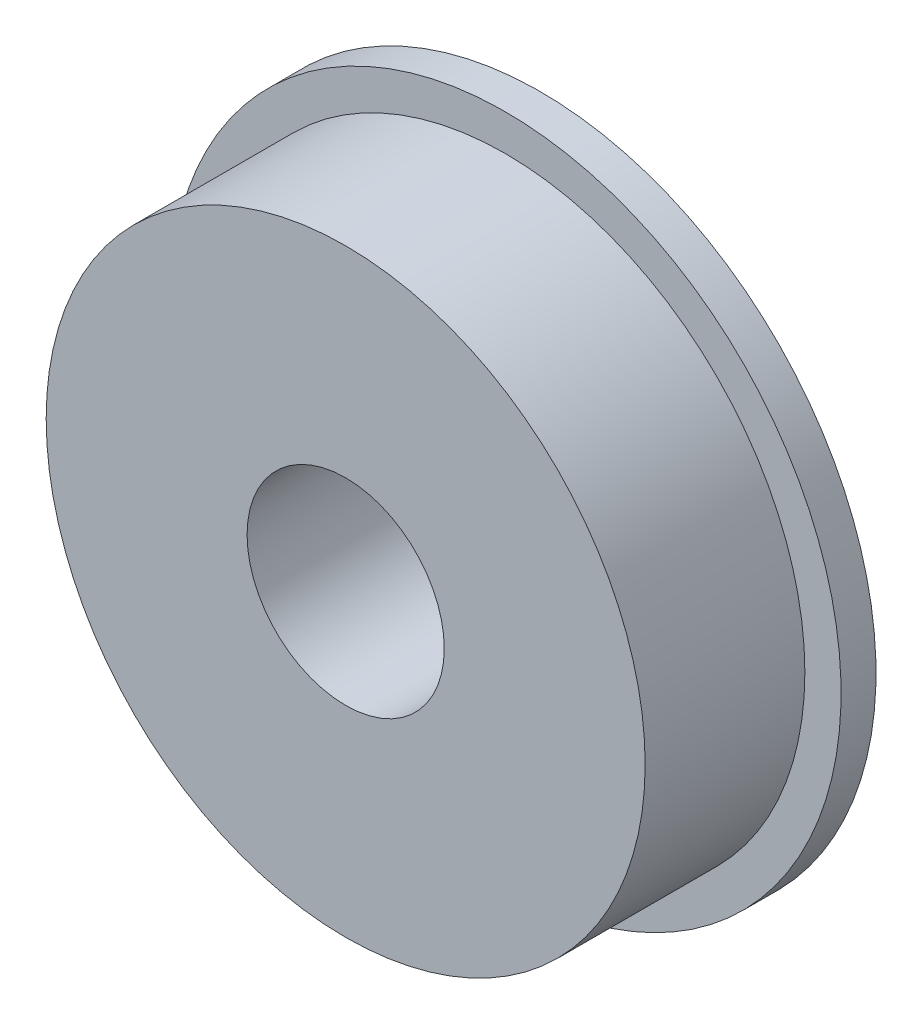
ISO-10303-21;
HEADER;
FILE_DESCRIPTION(('STEP AP214'),'2;1');
FILE_NAME('part.step','',(''),(''),'','','');
FILE_SCHEMA(('AUTOMOTIVE_DESIGN { 1 0 10303 214 1 1 1 1 }'));
ENDSEC;
DATA;
#1=APPLICATION_CONTEXT('core data for automotive mechanical design processes');
#2=APPLICATION_PROTOCOL_DEFINITION('international standard','automotive_design',2000,#1);
#3=PRODUCT_CONTEXT('',#1,'mechanical');
#4=PRODUCT('Part','Part','',(#3));
#5=PRODUCT_RELATED_PRODUCT_CATEGORY('part','',(#4));
#6=PRODUCT_DEFINITION_FORMATION('','',#4);
#7=PRODUCT_DEFINITION_CONTEXT('part definition',#1,'design');
#8=PRODUCT_DEFINITION('design','',#6,#7);
#9=PRODUCT_DEFINITION_SHAPE('','',#8);
#10=(LENGTH_UNIT() NAMED_UNIT(*) SI_UNIT(.MILLI.,.METRE.));
#11=(NAMED_UNIT(*) PLANE_ANGLE_UNIT() SI_UNIT($,.RADIAN.));
#12=(NAMED_UNIT(*) SI_UNIT($,.STERADIAN.) SOLID_ANGLE_UNIT());
#13=UNCERTAINTY_MEASURE_WITH_UNIT(LENGTH_MEASURE(1.E-05),#10,'distance_accuracy_value','');
#14=(GEOMETRIC_REPRESENTATION_CONTEXT(3) GLOBAL_UNCERTAINTY_ASSIGNED_CONTEXT((#13)) GLOBAL_UNIT_ASSIGNED_CONTEXT((#10,
#11,#12)) REPRESENTATION_CONTEXT('',''));
#15=CARTESIAN_POINT('',(0.,0.,0.));
#16=DIRECTION('',(0.,0.,1.));
#17=DIRECTION('',(1.,0.,0.));
#18=AXIS2_PLACEMENT_3D('',#15,#16,#17);
#19=CARTESIAN_POINT('',(0.,0.,6.4));
#20=DIRECTION('',(0.,0.,1.));
#21=DIRECTION('',(1.,0.,0.));
#22=AXIS2_PLACEMENT_3D('',#19,#20,#21);
#23=PLANE('',#22);
#24=CARTESIAN_POINT('',(0.,0.,6.4));
#25=DIRECTION('',(0.,0.,1.));
#26=DIRECTION('',(1.,0.,0.));
#27=AXIS2_PLACEMENT_3D('',#24,#25,#26);
#28=CIRCLE('',#27,12.);
#29=CARTESIAN_POINT('',(12.,0.,6.4));
#30=VERTEX_POINT('',#29);
#31=EDGE_CURVE('E10',#30,#30,#28,.T.);
#32=ORIENTED_EDGE('',*,*,#31,.T.);
#33=EDGE_LOOP('',(#32));
#34=FACE_BOUND('',#33,.T.);
#35=CARTESIAN_POINT('',(0.,0.,6.4));
#36=DIRECTION('',(0.,0.,1.));
#37=DIRECTION('',(1.,0.,0.));
#38=AXIS2_PLACEMENT_3D('',#35,#36,#37);
#39=CIRCLE('',#38,3.95);
#40=CARTESIAN_POINT('',(3.95,0.,6.4));
#41=VERTEX_POINT('',#40);
#42=EDGE_CURVE('E42',#41,#41,#39,.T.);
#43=ORIENTED_EDGE('',*,*,#42,.F.);
#44=EDGE_LOOP('',(#43));
#45=FACE_BOUND('',#44,.T.);
#46=ADVANCED_FACE('F34',(#34,#45),#23,.T.);
#47=CARTESIAN_POINT('',(0.,0.,6.4));
#48=DIRECTION('',(0.,0.,-1.));
#49=DIRECTION('',(-1.,0.,0.));
#50=AXIS2_PLACEMENT_3D('',#47,#48,#49);
#51=CYLINDRICAL_SURFACE('',#50,12.);
#52=ORIENTED_EDGE('',*,*,#31,.F.);
#53=EDGE_LOOP('',(#52));
#54=FACE_BOUND('',#53,.T.);
#55=CARTESIAN_POINT('',(0.,0.,0.));
#56=DIRECTION('',(0.,0.,1.));
#57=DIRECTION('',(1.,0.,0.));
#58=AXIS2_PLACEMENT_3D('',#55,#56,#57);
#59=CIRCLE('',#58,12.);
#60=CARTESIAN_POINT('',(12.,0.,0.));
#61=VERTEX_POINT('',#60);
#62=EDGE_CURVE('E38',#61,#61,#59,.T.);
#63=ORIENTED_EDGE('',*,*,#62,.T.);
#64=EDGE_LOOP('',(#63));
#65=FACE_BOUND('',#64,.T.);
#66=ADVANCED_FACE('F36',(#54,#65),#51,.T.);
#67=CARTESIAN_POINT('',(0.,0.,6.4));
#68=DIRECTION('',(0.,0.,-1.));
#69=DIRECTION('',(-1.,0.,0.));
#70=AXIS2_PLACEMENT_3D('',#67,#68,#69);
#71=CYLINDRICAL_SURFACE('',#70,3.95);
#72=ORIENTED_EDGE('',*,*,#42,.T.);
#73=EDGE_LOOP('',(#72));
#74=FACE_BOUND('',#73,.T.);
#75=CARTESIAN_POINT('',(0.,0.,-1.4));
#76=DIRECTION('',(0.,0.,-1.));
#77=DIRECTION('',(-1.,0.,0.));
#78=AXIS2_PLACEMENT_3D('',#75,#76,#77);
#79=CIRCLE('',#78,3.95);
#80=CARTESIAN_POINT('',(-3.95,0.,-1.4));
#81=VERTEX_POINT('',#80);
#82=EDGE_CURVE('E52',#81,#81,#79,.T.);
#83=ORIENTED_EDGE('',*,*,#82,.T.);
#84=EDGE_LOOP('',(#83));
#85=FACE_BOUND('',#84,.T.);
#86=ADVANCED_FACE('F58',(#74,#85),#71,.F.);
#87=CARTESIAN_POINT('',(0.,0.,-1.4));
#88=DIRECTION('',(0.,0.,-1.));
#89=DIRECTION('',(-1.,0.,0.));
#90=AXIS2_PLACEMENT_3D('',#87,#88,#89);
#91=PLANE('',#90);
#92=CARTESIAN_POINT('',(0.,0.,-1.4));
#93=DIRECTION('',(0.,0.,-1.));
#94=DIRECTION('',(-1.,0.,0.));
#95=AXIS2_PLACEMENT_3D('',#92,#93,#94);
#96=CIRCLE('',#95,13.45);
#97=CARTESIAN_POINT('',(-13.45,0.,-1.4));
#98=VERTEX_POINT('',#97);
#99=EDGE_CURVE('E51',#98,#98,#96,.T.);
#100=ORIENTED_EDGE('',*,*,#99,.T.);
#101=EDGE_LOOP('',(#100));
#102=FACE_BOUND('',#101,.T.);
#103=ORIENTED_EDGE('',*,*,#82,.F.);
#104=EDGE_LOOP('',(#103));
#105=FACE_BOUND('',#104,.T.);
#106=ADVANCED_FACE('F60',(#102,#105),#91,.T.);
#107=CARTESIAN_POINT('',(0.,0.,0.));
#108=DIRECTION('',(0.,0.,-1.));
#109=DIRECTION('',(-1.,0.,0.));
#110=AXIS2_PLACEMENT_3D('',#107,#108,#109);
#111=PLANE('',#110);
#112=ORIENTED_EDGE('',*,*,#62,.F.);
#113=EDGE_LOOP('',(#112));
#114=FACE_BOUND('',#113,.T.);
#115=CARTESIAN_POINT('',(0.,0.,0.));
#116=DIRECTION('',(0.,0.,-1.));
#117=DIRECTION('',(-1.,0.,0.));
#118=AXIS2_PLACEMENT_3D('',#115,#116,#117);
#119=CIRCLE('',#118,13.45);
#120=CARTESIAN_POINT('',(-13.45,0.,0.));
#121=VERTEX_POINT('',#120);
#122=EDGE_CURVE('E48',#121,#121,#119,.T.);
#123=ORIENTED_EDGE('',*,*,#122,.F.);
#124=EDGE_LOOP('',(#123));
#125=FACE_BOUND('',#124,.T.);
#126=ADVANCED_FACE('F62',(#114,#125),#111,.F.);
#127=CARTESIAN_POINT('',(0.,0.,-1.4));
#128=DIRECTION('',(0.,0.,1.));
#129=DIRECTION('',(1.,0.,0.));
#130=AXIS2_PLACEMENT_3D('',#127,#128,#129);
#131=CYLINDRICAL_SURFACE('',#130,13.45);
#132=ORIENTED_EDGE('',*,*,#99,.F.);
#133=EDGE_LOOP('',(#132));
#134=FACE_BOUND('',#133,.T.);
#135=ORIENTED_EDGE('',*,*,#122,.T.);
#136=EDGE_LOOP('',(#135));
#137=FACE_BOUND('',#136,.T.);
#138=ADVANCED_FACE('F69',(#134,#137),#131,.T.);
#139=CLOSED_SHELL('',(#46,#66,#86,#106,#126,#138));
#140=MANIFOLD_SOLID_BREP('B2',#139);
#141=ADVANCED_BREP_SHAPE_REPRESENTATION('',(#18,#140),#14);
#142=SHAPE_DEFINITION_REPRESENTATION(#9,#141);
ENDSEC;
END-ISO-10303-21;
